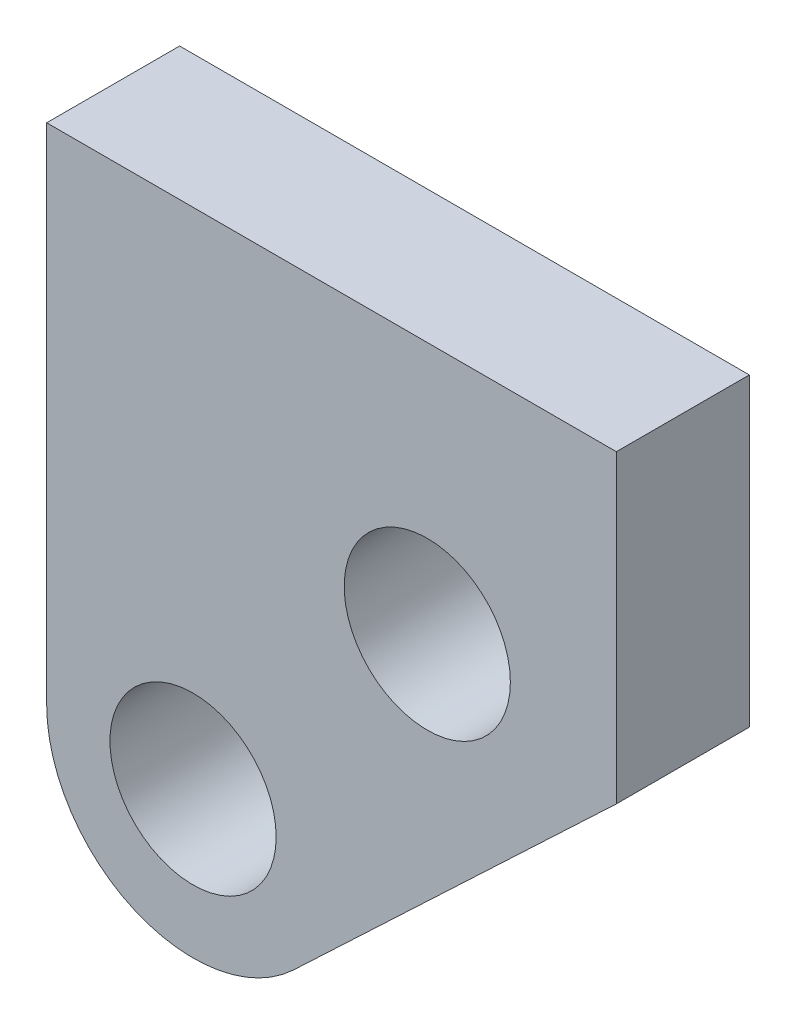
ISO-10303-21;
HEADER;
FILE_DESCRIPTION(('STEP AP214'),'2;1');
FILE_NAME('part.step','',(''),(''),'','','');
FILE_SCHEMA(('AUTOMOTIVE_DESIGN { 1 0 10303 214 1 1 1 1 }'));
ENDSEC;
DATA;
#1=APPLICATION_CONTEXT('core data for automotive mechanical design processes');
#2=APPLICATION_PROTOCOL_DEFINITION('international standard','automotive_design',2000,#1);
#3=PRODUCT_CONTEXT('',#1,'mechanical');
#4=PRODUCT('Part','Part','',(#3));
#5=PRODUCT_RELATED_PRODUCT_CATEGORY('part','',(#4));
#6=PRODUCT_DEFINITION_FORMATION('','',#4);
#7=PRODUCT_DEFINITION_CONTEXT('part definition',#1,'design');
#8=PRODUCT_DEFINITION('design','',#6,#7);
#9=PRODUCT_DEFINITION_SHAPE('','',#8);
#10=(LENGTH_UNIT() NAMED_UNIT(*) SI_UNIT(.MILLI.,.METRE.));
#11=(NAMED_UNIT(*) PLANE_ANGLE_UNIT() SI_UNIT($,.RADIAN.));
#12=(NAMED_UNIT(*) SI_UNIT($,.STERADIAN.) SOLID_ANGLE_UNIT());
#13=UNCERTAINTY_MEASURE_WITH_UNIT(LENGTH_MEASURE(1.E-05),#10,'distance_accuracy_value','');
#14=(GEOMETRIC_REPRESENTATION_CONTEXT(3) GLOBAL_UNCERTAINTY_ASSIGNED_CONTEXT((#13)) GLOBAL_UNIT_ASSIGNED_CONTEXT((#10,
#11,#12)) REPRESENTATION_CONTEXT('',''));
#15=CARTESIAN_POINT('',(0.,0.,0.));
#16=DIRECTION('',(0.,0.,1.));
#17=DIRECTION('',(1.,0.,0.));
#18=AXIS2_PLACEMENT_3D('',#15,#16,#17);
#19=CARTESIAN_POINT('',(54.0594805580869,22.7056662648686,-10.));
#20=DIRECTION('',(1.,0.,0.));
#21=DIRECTION('',(0.,0.,-1.));
#22=AXIS2_PLACEMENT_3D('',#19,#20,#21);
#23=PLANE('',#22);
#24=DIRECTION('',(0.,1.,0.));
#25=VECTOR('',#24,1.);
#26=CARTESIAN_POINT('',(54.0594805580869,22.7056662648686,0.));
#27=LINE('',#26,#25);
#28=CARTESIAN_POINT('',(54.0594805580869,-0.23891661839081,0.));
#29=VERTEX_POINT('',#28);
#30=CARTESIAN_POINT('',(54.0594805580869,22.7056662648686,0.));
#31=VERTEX_POINT('',#30);
#32=EDGE_CURVE('E110',#29,#31,#27,.T.);
#33=ORIENTED_EDGE('',*,*,#32,.F.);
#34=DIRECTION('',(0.,0.,1.));
#35=VECTOR('',#34,1.);
#36=CARTESIAN_POINT('',(54.0594805580869,-0.23891661839081,-10.));
#37=LINE('',#36,#35);
#38=CARTESIAN_POINT('',(54.0594805580869,-0.23891661839081,-10.));
#39=VERTEX_POINT('',#38);
#40=EDGE_CURVE('E11',#39,#29,#37,.T.);
#41=ORIENTED_EDGE('',*,*,#40,.F.);
#42=DIRECTION('',(0.,1.,0.));
#43=VECTOR('',#42,1.);
#44=CARTESIAN_POINT('',(54.0594805580869,22.7056662648686,-10.));
#45=LINE('',#44,#43);
#46=CARTESIAN_POINT('',(54.0594805580869,22.7056662648686,-10.));
#47=VERTEX_POINT('',#46);
#48=EDGE_CURVE('E105',#39,#47,#45,.T.);
#49=ORIENTED_EDGE('',*,*,#48,.T.);
#50=DIRECTION('',(0.,0.,1.));
#51=VECTOR('',#50,1.);
#52=CARTESIAN_POINT('',(54.0594805580869,22.7056662648686,-10.));
#53=LINE('',#52,#51);
#54=EDGE_CURVE('E36',#47,#31,#53,.T.);
#55=ORIENTED_EDGE('',*,*,#54,.T.);
#56=EDGE_LOOP('',(#33,#41,#49,#55));
#57=FACE_BOUND('',#56,.T.);
#58=ADVANCED_FACE('F33',(#57),#23,.T.);
#59=CARTESIAN_POINT('',(29.785193592599,-23.187206185045,-10.));
#60=DIRECTION('',(0.686980631745254,-0.726675726584349,0.));
#61=DIRECTION('',(0.726675726584349,0.686980631745254,0.));
#62=AXIS2_PLACEMENT_3D('',#59,#60,#61);
#63=PLANE('',#62);
#64=DIRECTION('',(0.726675726584349,0.686980631745254,0.));
#65=VECTOR('',#64,1.);
#66=CARTESIAN_POINT('',(29.785193592599,-23.187206185045,0.));
#67=LINE('',#66,#65);
#68=CARTESIAN_POINT('',(29.785193592599,-23.187206185045,0.));
#69=VERTEX_POINT('',#68);
#70=EDGE_CURVE('E120',#69,#29,#67,.T.);
#71=ORIENTED_EDGE('',*,*,#70,.F.);
#72=DIRECTION('',(0.,0.,1.));
#73=VECTOR('',#72,1.);
#74=CARTESIAN_POINT('',(29.785193592599,-23.187206185045,-10.));
#75=LINE('',#74,#73);
#76=CARTESIAN_POINT('',(29.785193592599,-23.187206185045,-10.));
#77=VERTEX_POINT('',#76);
#78=EDGE_CURVE('E42',#77,#69,#75,.T.);
#79=ORIENTED_EDGE('',*,*,#78,.F.);
#80=DIRECTION('',(0.726675726584349,0.686980631745254,0.));
#81=VECTOR('',#80,1.);
#82=CARTESIAN_POINT('',(29.785193592599,-23.187206185045,-10.));
#83=LINE('',#82,#81);
#84=EDGE_CURVE('E100',#77,#39,#83,.T.);
#85=ORIENTED_EDGE('',*,*,#84,.T.);
#86=ORIENTED_EDGE('',*,*,#40,.T.);
#87=EDGE_LOOP('',(#71,#79,#85,#86));
#88=FACE_BOUND('',#87,.T.);
#89=ADVANCED_FACE('F126',(#88),#63,.T.);
#90=CARTESIAN_POINT('',(22.2213904629931,-15.1863516034771,-10.));
#91=DIRECTION('',(0.,0.,1.));
#92=DIRECTION('',(1.,0.,0.));
#93=AXIS2_PLACEMENT_3D('',#90,#91,#92);
#94=CYLINDRICAL_SURFACE('',#93,11.01021306873);
#95=CARTESIAN_POINT('',(22.2213904629931,-15.1863516034771,0.));
#96=DIRECTION('',(0.,0.,1.));
#97=DIRECTION('',(1.,0.,0.));
#98=AXIS2_PLACEMENT_3D('',#95,#96,#97);
#99=CIRCLE('',#98,11.01021306873);
#100=CARTESIAN_POINT('',(11.2111773942631,-15.1863516034771,0.));
#101=VERTEX_POINT('',#100);
#102=EDGE_CURVE('E89',#101,#69,#99,.T.);
#103=ORIENTED_EDGE('',*,*,#102,.F.);
#104=DIRECTION('',(0.,0.,1.));
#105=VECTOR('',#104,1.);
#106=CARTESIAN_POINT('',(11.2111773942631,-15.1863516034771,-10.));
#107=LINE('',#106,#105);
#108=CARTESIAN_POINT('',(11.2111773942631,-15.1863516034771,-10.));
#109=VERTEX_POINT('',#108);
#110=EDGE_CURVE('E84',#109,#101,#107,.T.);
#111=ORIENTED_EDGE('',*,*,#110,.F.);
#112=CARTESIAN_POINT('',(22.2213904629931,-15.1863516034771,-10.));
#113=DIRECTION('',(0.,0.,1.));
#114=DIRECTION('',(1.,0.,0.));
#115=AXIS2_PLACEMENT_3D('',#112,#113,#114);
#116=CIRCLE('',#115,11.01021306873);
#117=EDGE_CURVE('E87',#109,#77,#116,.T.);
#118=ORIENTED_EDGE('',*,*,#117,.T.);
#119=ORIENTED_EDGE('',*,*,#78,.T.);
#120=EDGE_LOOP('',(#103,#111,#118,#119));
#121=FACE_BOUND('',#120,.T.);
#122=ADVANCED_FACE('F86',(#121),#94,.T.);
#123=CARTESIAN_POINT('',(11.2111773942631,22.7056662648686,-10.));
#124=DIRECTION('',(-1.,0.,0.));
#125=DIRECTION('',(0.,-1.,0.));
#126=AXIS2_PLACEMENT_3D('',#123,#124,#125);
#127=PLANE('',#126);
#128=DIRECTION('',(0.,-1.,0.));
#129=VECTOR('',#128,1.);
#130=CARTESIAN_POINT('',(11.2111773942631,22.7056662648686,0.));
#131=LINE('',#130,#129);
#132=CARTESIAN_POINT('',(11.2111773942631,22.7056662648686,0.));
#133=VERTEX_POINT('',#132);
#134=EDGE_CURVE('E117',#133,#101,#131,.T.);
#135=ORIENTED_EDGE('',*,*,#134,.F.);
#136=DIRECTION('',(0.,0.,1.));
#137=VECTOR('',#136,1.);
#138=CARTESIAN_POINT('',(11.2111773942631,22.7056662648686,-10.));
#139=LINE('',#138,#137);
#140=CARTESIAN_POINT('',(11.2111773942631,22.7056662648686,-10.));
#141=VERTEX_POINT('',#140);
#142=EDGE_CURVE('E94',#141,#133,#139,.T.);
#143=ORIENTED_EDGE('',*,*,#142,.F.);
#144=DIRECTION('',(0.,-1.,0.));
#145=VECTOR('',#144,1.);
#146=CARTESIAN_POINT('',(11.2111773942631,22.7056662648686,-10.));
#147=LINE('',#146,#145);
#148=EDGE_CURVE('E99',#141,#109,#147,.T.);
#149=ORIENTED_EDGE('',*,*,#148,.T.);
#150=ORIENTED_EDGE('',*,*,#110,.T.);
#151=EDGE_LOOP('',(#135,#143,#149,#150));
#152=FACE_BOUND('',#151,.T.);
#153=ADVANCED_FACE('F102',(#152),#127,.T.);
#154=CARTESIAN_POINT('',(54.0594805580869,22.7056662648686,-10.));
#155=DIRECTION('',(0.,1.,0.));
#156=DIRECTION('',(-1.,0.,0.));
#157=AXIS2_PLACEMENT_3D('',#154,#155,#156);
#158=PLANE('',#157);
#159=DIRECTION('',(-1.,0.,0.));
#160=VECTOR('',#159,1.);
#161=CARTESIAN_POINT('',(54.0594805580869,22.7056662648686,0.));
#162=LINE('',#161,#160);
#163=EDGE_CURVE('E113',#31,#133,#162,.T.);
#164=ORIENTED_EDGE('',*,*,#163,.F.);
#165=ORIENTED_EDGE('',*,*,#54,.F.);
#166=DIRECTION('',(-1.,0.,0.));
#167=VECTOR('',#166,1.);
#168=CARTESIAN_POINT('',(54.0594805580869,22.7056662648686,-10.));
#169=LINE('',#168,#167);
#170=EDGE_CURVE('E103',#47,#141,#169,.T.);
#171=ORIENTED_EDGE('',*,*,#170,.T.);
#172=ORIENTED_EDGE('',*,*,#142,.T.);
#173=EDGE_LOOP('',(#164,#165,#171,#172));
#174=FACE_BOUND('',#173,.T.);
#175=ADVANCED_FACE('F123',(#174),#158,.T.);
#176=CARTESIAN_POINT('',(22.2213904629931,-15.1863516034771,-10.));
#177=DIRECTION('',(0.,0.,1.));
#178=DIRECTION('',(1.,0.,0.));
#179=AXIS2_PLACEMENT_3D('',#176,#177,#178);
#180=PLANE('',#179);
#181=CARTESIAN_POINT('',(39.837339903571,3.70444137397563,-10.));
#182=DIRECTION('',(0.,0.,1.));
#183=DIRECTION('',(1.,0.,0.));
#184=AXIS2_PLACEMENT_3D('',#181,#182,#183);
#185=CIRCLE('',#184,6.25);
#186=CARTESIAN_POINT('',(46.087339903571,3.70444137397563,-10.));
#187=VERTEX_POINT('',#186);
#188=EDGE_CURVE('E161',#187,#187,#185,.T.);
#189=ORIENTED_EDGE('',*,*,#188,.T.);
#190=EDGE_LOOP('',(#189));
#191=FACE_BOUND('',#190,.T.);
#192=CARTESIAN_POINT('',(22.2213904629931,-15.1863516034771,-10.));
#193=DIRECTION('',(0.,0.,1.));
#194=DIRECTION('',(1.,0.,0.));
#195=AXIS2_PLACEMENT_3D('',#192,#193,#194);
#196=CIRCLE('',#195,6.25);
#197=CARTESIAN_POINT('',(28.4713904629931,-15.1863516034771,-10.));
#198=VERTEX_POINT('',#197);
#199=EDGE_CURVE('E114',#198,#198,#196,.T.);
#200=ORIENTED_EDGE('',*,*,#199,.T.);
#201=EDGE_LOOP('',(#200));
#202=FACE_BOUND('',#201,.T.);
#203=ORIENTED_EDGE('',*,*,#48,.F.);
#204=ORIENTED_EDGE('',*,*,#84,.F.);
#205=ORIENTED_EDGE('',*,*,#117,.F.);
#206=ORIENTED_EDGE('',*,*,#148,.F.);
#207=ORIENTED_EDGE('',*,*,#170,.F.);
#208=EDGE_LOOP('',(#203,#204,#205,#206,#207));
#209=FACE_BOUND('',#208,.T.);
#210=ADVANCED_FACE('F98',(#191,#202,#209),#180,.F.);
#211=CARTESIAN_POINT('',(22.2213904629931,-15.1863516034771,0.));
#212=DIRECTION('',(0.,0.,1.));
#213=DIRECTION('',(1.,0.,0.));
#214=AXIS2_PLACEMENT_3D('',#211,#212,#213);
#215=PLANE('',#214);
#216=CARTESIAN_POINT('',(39.837339903571,3.70444137397563,0.));
#217=DIRECTION('',(0.,0.,1.));
#218=DIRECTION('',(1.,0.,0.));
#219=AXIS2_PLACEMENT_3D('',#216,#217,#218);
#220=CIRCLE('',#219,6.25);
#221=CARTESIAN_POINT('',(46.087339903571,3.70444137397563,0.));
#222=VERTEX_POINT('',#221);
#223=EDGE_CURVE('E164',#222,#222,#220,.T.);
#224=ORIENTED_EDGE('',*,*,#223,.F.);
#225=EDGE_LOOP('',(#224));
#226=FACE_BOUND('',#225,.T.);
#227=CARTESIAN_POINT('',(22.2213904629931,-15.1863516034771,0.));
#228=DIRECTION('',(0.,0.,1.));
#229=DIRECTION('',(1.,0.,0.));
#230=AXIS2_PLACEMENT_3D('',#227,#228,#229);
#231=CIRCLE('',#230,6.25);
#232=CARTESIAN_POINT('',(28.4713904629931,-15.1863516034771,0.));
#233=VERTEX_POINT('',#232);
#234=EDGE_CURVE('E166',#233,#233,#231,.T.);
#235=ORIENTED_EDGE('',*,*,#234,.F.);
#236=EDGE_LOOP('',(#235));
#237=FACE_BOUND('',#236,.T.);
#238=ORIENTED_EDGE('',*,*,#32,.T.);
#239=ORIENTED_EDGE('',*,*,#163,.T.);
#240=ORIENTED_EDGE('',*,*,#134,.T.);
#241=ORIENTED_EDGE('',*,*,#102,.T.);
#242=ORIENTED_EDGE('',*,*,#70,.T.);
#243=EDGE_LOOP('',(#238,#239,#240,#241,#242));
#244=FACE_BOUND('',#243,.T.);
#245=ADVANCED_FACE('F125',(#226,#237,#244),#215,.T.);
#246=CARTESIAN_POINT('',(22.2213904629931,-15.1863516034771,-10.));
#247=DIRECTION('',(0.,0.,1.));
#248=DIRECTION('',(1.,0.,0.));
#249=AXIS2_PLACEMENT_3D('',#246,#247,#248);
#250=CYLINDRICAL_SURFACE('',#249,6.25);
#251=ORIENTED_EDGE('',*,*,#199,.F.);
#252=EDGE_LOOP('',(#251));
#253=FACE_BOUND('',#252,.T.);
#254=ORIENTED_EDGE('',*,*,#234,.T.);
#255=EDGE_LOOP('',(#254));
#256=FACE_BOUND('',#255,.T.);
#257=ADVANCED_FACE('F146',(#253,#256),#250,.F.);
#258=CARTESIAN_POINT('',(39.837339903571,3.70444137397563,-10.));
#259=DIRECTION('',(0.,0.,1.));
#260=DIRECTION('',(1.,0.,0.));
#261=AXIS2_PLACEMENT_3D('',#258,#259,#260);
#262=CYLINDRICAL_SURFACE('',#261,6.25);
#263=ORIENTED_EDGE('',*,*,#188,.F.);
#264=EDGE_LOOP('',(#263));
#265=FACE_BOUND('',#264,.T.);
#266=ORIENTED_EDGE('',*,*,#223,.T.);
#267=EDGE_LOOP('',(#266));
#268=FACE_BOUND('',#267,.T.);
#269=ADVANCED_FACE('F153',(#265,#268),#262,.F.);
#270=CLOSED_SHELL('',(#58,#89,#122,#153,#175,#210,#245,#257,#269));
#271=MANIFOLD_SOLID_BREP('B2',#270);
#272=ADVANCED_BREP_SHAPE_REPRESENTATION('',(#18,#271),#14);
#273=SHAPE_DEFINITION_REPRESENTATION(#9,#272);
ENDSEC;
END-ISO-10303-21;
